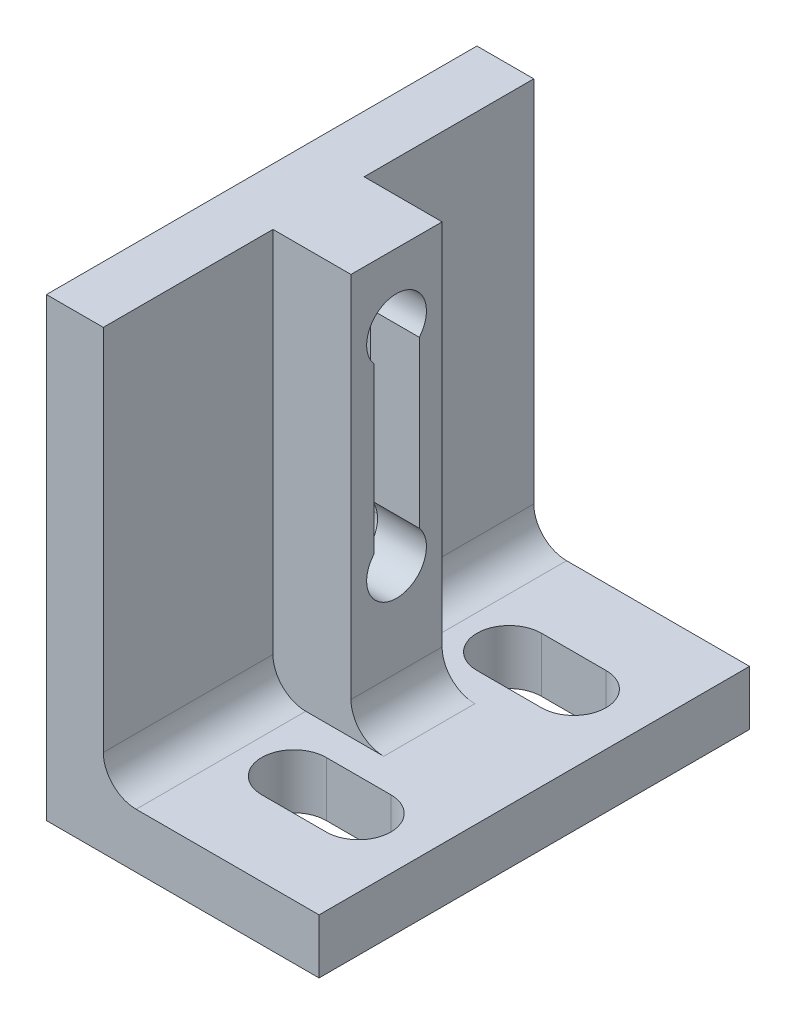
ISO-10303-21;
HEADER;
FILE_DESCRIPTION(('STEP AP214'),'2;1');
FILE_NAME('part.step','',(''),(''),'','','');
FILE_SCHEMA(('AUTOMOTIVE_DESIGN { 1 0 10303 214 1 1 1 1 }'));
ENDSEC;
DATA;
#1=APPLICATION_CONTEXT('core data for automotive mechanical design processes');
#2=APPLICATION_PROTOCOL_DEFINITION('international standard','automotive_design',2000,#1);
#3=PRODUCT_CONTEXT('',#1,'mechanical');
#4=PRODUCT('Part','Part','',(#3));
#5=PRODUCT_RELATED_PRODUCT_CATEGORY('part','',(#4));
#6=PRODUCT_DEFINITION_FORMATION('','',#4);
#7=PRODUCT_DEFINITION_CONTEXT('part definition',#1,'design');
#8=PRODUCT_DEFINITION('design','',#6,#7);
#9=PRODUCT_DEFINITION_SHAPE('','',#8);
#10=(LENGTH_UNIT() NAMED_UNIT(*) SI_UNIT(.MILLI.,.METRE.));
#11=(NAMED_UNIT(*) PLANE_ANGLE_UNIT() SI_UNIT($,.RADIAN.));
#12=(NAMED_UNIT(*) SI_UNIT($,.STERADIAN.) SOLID_ANGLE_UNIT());
#13=UNCERTAINTY_MEASURE_WITH_UNIT(LENGTH_MEASURE(1.E-05),#10,'distance_accuracy_value','');
#14=(GEOMETRIC_REPRESENTATION_CONTEXT(3) GLOBAL_UNCERTAINTY_ASSIGNED_CONTEXT((#13)) GLOBAL_UNIT_ASSIGNED_CONTEXT((#10,
#11,#12)) REPRESENTATION_CONTEXT('',''));
#15=CARTESIAN_POINT('',(0.,0.,0.));
#16=DIRECTION('',(0.,0.,1.));
#17=DIRECTION('',(1.,0.,0.));
#18=AXIS2_PLACEMENT_3D('',#15,#16,#17);
#19=CARTESIAN_POINT('',(0.,0.,-30.));
#20=DIRECTION('',(1.,0.,0.));
#21=DIRECTION('',(0.,0.,-1.));
#22=AXIS2_PLACEMENT_3D('',#19,#20,#21);
#23=PLANE('',#22);
#24=DIRECTION('',(0.,1.,0.));
#25=VECTOR('',#24,1.);
#26=CARTESIAN_POINT('',(0.,0.,0.));
#27=LINE('',#26,#25);
#28=CARTESIAN_POINT('',(0.,0.,0.));
#29=VERTEX_POINT('',#28);
#30=CARTESIAN_POINT('',(0.,31.75,0.));
#31=VERTEX_POINT('',#30);
#32=EDGE_CURVE('E393',#29,#31,#27,.T.);
#33=ORIENTED_EDGE('',*,*,#32,.T.);
#34=DIRECTION('',(0.,0.,1.));
#35=VECTOR('',#34,1.);
#36=CARTESIAN_POINT('',(0.,31.75,-30.));
#37=LINE('',#36,#35);
#38=CARTESIAN_POINT('',(0.,31.75,-30.));
#39=VERTEX_POINT('',#38);
#40=EDGE_CURVE('E390',#39,#31,#37,.T.);
#41=ORIENTED_EDGE('',*,*,#40,.F.);
#42=DIRECTION('',(0.,1.,0.));
#43=VECTOR('',#42,1.);
#44=CARTESIAN_POINT('',(0.,0.,-30.));
#45=LINE('',#44,#43);
#46=CARTESIAN_POINT('',(0.,0.,-30.));
#47=VERTEX_POINT('',#46);
#48=EDGE_CURVE('E380',#47,#39,#45,.T.);
#49=ORIENTED_EDGE('',*,*,#48,.F.);
#50=DIRECTION('',(0.,0.,1.));
#51=VECTOR('',#50,1.);
#52=CARTESIAN_POINT('',(0.,0.,-30.));
#53=LINE('',#52,#51);
#54=EDGE_CURVE('E407',#47,#29,#53,.T.);
#55=ORIENTED_EDGE('',*,*,#54,.T.);
#56=EDGE_LOOP('',(#33,#41,#49,#55));
#57=FACE_BOUND('',#56,.T.);
#58=CARTESIAN_POINT('',(0.,12.7,-15.));
#59=DIRECTION('',(1.,0.,0.));
#60=DIRECTION('',(0.,0.,-1.));
#61=AXIS2_PLACEMENT_3D('',#58,#59,#60);
#62=CIRCLE('',#61,2.3749);
#63=CARTESIAN_POINT('',(0.,12.7,-12.6251));
#64=VERTEX_POINT('',#63);
#65=CARTESIAN_POINT('',(0.,12.7,-17.3749));
#66=VERTEX_POINT('',#65);
#67=EDGE_CURVE('E61',#64,#66,#62,.T.);
#68=ORIENTED_EDGE('',*,*,#67,.T.);
#69=DIRECTION('',(0.,1.,0.));
#70=VECTOR('',#69,1.);
#71=CARTESIAN_POINT('',(0.,12.7,-17.3749));
#72=LINE('',#71,#70);
#73=CARTESIAN_POINT('',(0.,26.924,-17.3749));
#74=VERTEX_POINT('',#73);
#75=EDGE_CURVE('E255',#66,#74,#72,.T.);
#76=ORIENTED_EDGE('',*,*,#75,.T.);
#77=CARTESIAN_POINT('',(0.,26.924,-15.));
#78=DIRECTION('',(1.,0.,0.));
#79=DIRECTION('',(0.,0.,-1.));
#80=AXIS2_PLACEMENT_3D('',#77,#78,#79);
#81=CIRCLE('',#80,2.3749);
#82=CARTESIAN_POINT('',(0.,26.924,-12.6251));
#83=VERTEX_POINT('',#82);
#84=EDGE_CURVE('E834',#74,#83,#81,.T.);
#85=ORIENTED_EDGE('',*,*,#84,.T.);
#86=DIRECTION('',(0.,-1.,0.));
#87=VECTOR('',#86,1.);
#88=CARTESIAN_POINT('',(0.,12.7,-12.6251));
#89=LINE('',#88,#87);
#90=EDGE_CURVE('E251',#83,#64,#89,.T.);
#91=ORIENTED_EDGE('',*,*,#90,.T.);
#92=EDGE_LOOP('',(#68,#76,#85,#91));
#93=FACE_BOUND('',#92,.T.);
#94=ADVANCED_FACE('F46',(#57,#93),#23,.F.);
#95=CARTESIAN_POINT('',(0.,3.81,-30.));
#96=DIRECTION('',(0.,1.,0.));
#97=DIRECTION('',(0.,0.,1.));
#98=AXIS2_PLACEMENT_3D('',#95,#96,#97);
#99=PLANE('',#98);
#100=DIRECTION('',(1.,0.,0.));
#101=VECTOR('',#100,1.);
#102=CARTESIAN_POINT('',(14.2502,3.81,-5.25));
#103=LINE('',#102,#101);
#104=CARTESIAN_POINT('',(9.7502,3.81,-5.25));
#105=VERTEX_POINT('',#104);
#106=CARTESIAN_POINT('',(14.2502,3.81,-5.25));
#107=VERTEX_POINT('',#106);
#108=EDGE_CURVE('E328',#105,#107,#103,.T.);
#109=ORIENTED_EDGE('',*,*,#108,.F.);
#110=CARTESIAN_POINT('',(9.7502,3.81,-7.5));
#111=DIRECTION('',(0.,1.,0.));
#112=DIRECTION('',(0.,0.,1.));
#113=AXIS2_PLACEMENT_3D('',#110,#111,#112);
#114=CIRCLE('',#113,2.25);
#115=CARTESIAN_POINT('',(9.7502,3.81,-9.75));
#116=VERTEX_POINT('',#115);
#117=EDGE_CURVE('E312',#116,#105,#114,.T.);
#118=ORIENTED_EDGE('',*,*,#117,.F.);
#119=DIRECTION('',(-1.,0.,0.));
#120=VECTOR('',#119,1.);
#121=CARTESIAN_POINT('',(9.7502,3.81,-9.75));
#122=LINE('',#121,#120);
#123=CARTESIAN_POINT('',(14.2502,3.81,-9.75));
#124=VERTEX_POINT('',#123);
#125=EDGE_CURVE('E317',#124,#116,#122,.T.);
#126=ORIENTED_EDGE('',*,*,#125,.F.);
#127=CARTESIAN_POINT('',(14.2502,3.81,-7.5));
#128=DIRECTION('',(0.,1.,0.));
#129=DIRECTION('',(0.,0.,1.));
#130=AXIS2_PLACEMENT_3D('',#127,#128,#129);
#131=CIRCLE('',#130,2.25);
#132=EDGE_CURVE('E331',#107,#124,#131,.T.);
#133=ORIENTED_EDGE('',*,*,#132,.F.);
#134=EDGE_LOOP('',(#109,#118,#126,#133));
#135=FACE_BOUND('',#134,.T.);
#136=DIRECTION('',(1.,0.,0.));
#137=VECTOR('',#136,1.);
#138=CARTESIAN_POINT('',(9.7502,3.81,-20.25));
#139=LINE('',#138,#137);
#140=CARTESIAN_POINT('',(9.7502,3.81,-20.25));
#141=VERTEX_POINT('',#140);
#142=CARTESIAN_POINT('',(14.2502,3.81,-20.25));
#143=VERTEX_POINT('',#142);
#144=EDGE_CURVE('E349',#141,#143,#139,.T.);
#145=ORIENTED_EDGE('',*,*,#144,.F.);
#146=CARTESIAN_POINT('',(9.7502,3.81,-22.5));
#147=DIRECTION('',(0.,1.,0.));
#148=DIRECTION('',(0.,0.,1.));
#149=AXIS2_PLACEMENT_3D('',#146,#147,#148);
#150=CIRCLE('',#149,2.25);
#151=CARTESIAN_POINT('',(9.7502,3.81,-24.75));
#152=VERTEX_POINT('',#151);
#153=EDGE_CURVE('E363',#152,#141,#150,.T.);
#154=ORIENTED_EDGE('',*,*,#153,.F.);
#155=DIRECTION('',(-1.,0.,0.));
#156=VECTOR('',#155,1.);
#157=CARTESIAN_POINT('',(14.2502,3.81,-24.75));
#158=LINE('',#157,#156);
#159=CARTESIAN_POINT('',(14.2502,3.81,-24.75));
#160=VERTEX_POINT('',#159);
#161=EDGE_CURVE('E360',#160,#152,#158,.T.);
#162=ORIENTED_EDGE('',*,*,#161,.F.);
#163=CARTESIAN_POINT('',(14.2502,3.81,-22.5));
#164=DIRECTION('',(0.,1.,0.));
#165=DIRECTION('',(0.,0.,1.));
#166=AXIS2_PLACEMENT_3D('',#163,#164,#165);
#167=CIRCLE('',#166,2.25);
#168=EDGE_CURVE('E338',#143,#160,#167,.T.);
#169=ORIENTED_EDGE('',*,*,#168,.F.);
#170=EDGE_LOOP('',(#145,#154,#162,#169));
#171=FACE_BOUND('',#170,.T.);
#172=DIRECTION('',(1.,0.,0.));
#173=VECTOR('',#172,1.);
#174=CARTESIAN_POINT('',(9.39799999999985,3.81,-11.825));
#175=LINE('',#174,#173);
#176=CARTESIAN_POINT('',(6.24840000000002,3.81,-11.825));
#177=VERTEX_POINT('',#176);
#178=CARTESIAN_POINT('',(11.684,3.81,-11.825));
#179=VERTEX_POINT('',#178);
#180=EDGE_CURVE('E278',#177,#179,#175,.T.);
#181=ORIENTED_EDGE('',*,*,#180,.F.);
#182=DIRECTION('',(0.,0.,-1.));
#183=VECTOR('',#182,1.);
#184=CARTESIAN_POINT('',(6.24840000000002,3.81,-30.));
#185=LINE('',#184,#183);
#186=CARTESIAN_POINT('',(6.24840000000002,3.81,0.));
#187=VERTEX_POINT('',#186);
#188=EDGE_CURVE('E438',#177,#187,#185,.F.);
#189=ORIENTED_EDGE('',*,*,#188,.T.);
#190=DIRECTION('',(1.,0.,0.));
#191=VECTOR('',#190,1.);
#192=CARTESIAN_POINT('',(0.,3.81,0.));
#193=LINE('',#192,#191);
#194=CARTESIAN_POINT('',(19.,3.81,0.));
#195=VERTEX_POINT('',#194);
#196=EDGE_CURVE('E381',#195,#187,#193,.F.);
#197=ORIENTED_EDGE('',*,*,#196,.F.);
#198=DIRECTION('',(0.,0.,1.));
#199=VECTOR('',#198,1.);
#200=CARTESIAN_POINT('',(19.,3.81,-30.));
#201=LINE('',#200,#199);
#202=CARTESIAN_POINT('',(19.,3.81,-30.));
#203=VERTEX_POINT('',#202);
#204=EDGE_CURVE('E401',#203,#195,#201,.T.);
#205=ORIENTED_EDGE('',*,*,#204,.F.);
#206=DIRECTION('',(1.,0.,0.));
#207=VECTOR('',#206,1.);
#208=CARTESIAN_POINT('',(0.,3.81,-30.));
#209=LINE('',#208,#207);
#210=CARTESIAN_POINT('',(6.24840000000002,3.81,-30.));
#211=VERTEX_POINT('',#210);
#212=EDGE_CURVE('E387',#203,#211,#209,.F.);
#213=ORIENTED_EDGE('',*,*,#212,.T.);
#214=DIRECTION('',(0.,0.,-1.));
#215=VECTOR('',#214,1.);
#216=CARTESIAN_POINT('',(6.24840000000002,3.81,-30.));
#217=LINE('',#216,#215);
#218=CARTESIAN_POINT('',(6.24840000000002,3.81,-18.175));
#219=VERTEX_POINT('',#218);
#220=EDGE_CURVE('E436',#211,#219,#217,.F.);
#221=ORIENTED_EDGE('',*,*,#220,.T.);
#222=DIRECTION('',(-1.,0.,0.));
#223=VECTOR('',#222,1.);
#224=CARTESIAN_POINT('',(9.39799999999985,3.81,-18.175));
#225=LINE('',#224,#223);
#226=CARTESIAN_POINT('',(11.684,3.81,-18.175));
#227=VERTEX_POINT('',#226);
#228=EDGE_CURVE('E284',#227,#219,#225,.T.);
#229=ORIENTED_EDGE('',*,*,#228,.F.);
#230=DIRECTION('',(0.,0.,1.));
#231=VECTOR('',#230,1.);
#232=CARTESIAN_POINT('',(11.684,3.81,-11.825));
#233=LINE('',#232,#231);
#234=EDGE_CURVE('E421',#227,#179,#233,.T.);
#235=ORIENTED_EDGE('',*,*,#234,.T.);
#236=EDGE_LOOP('',(#181,#189,#197,#205,#213,#221,#229,#235));
#237=FACE_BOUND('',#236,.T.);
#238=ADVANCED_FACE('F455',(#135,#171,#237),#99,.T.);
#239=CARTESIAN_POINT('',(19.,3.81,-30.));
#240=DIRECTION('',(-1.,0.,0.));
#241=DIRECTION('',(0.,-1.,0.));
#242=AXIS2_PLACEMENT_3D('',#239,#240,#241);
#243=PLANE('',#242);
#244=DIRECTION('',(0.,-1.,0.));
#245=VECTOR('',#244,1.);
#246=CARTESIAN_POINT('',(19.,3.81,0.));
#247=LINE('',#246,#245);
#248=CARTESIAN_POINT('',(19.,0.,0.));
#249=VERTEX_POINT('',#248);
#250=EDGE_CURVE('E397',#195,#249,#247,.T.);
#251=ORIENTED_EDGE('',*,*,#250,.T.);
#252=DIRECTION('',(0.,0.,1.));
#253=VECTOR('',#252,1.);
#254=CARTESIAN_POINT('',(19.,0.,-30.));
#255=LINE('',#254,#253);
#256=CARTESIAN_POINT('',(19.,0.,-30.));
#257=VERTEX_POINT('',#256);
#258=EDGE_CURVE('E404',#257,#249,#255,.T.);
#259=ORIENTED_EDGE('',*,*,#258,.F.);
#260=DIRECTION('',(0.,-1.,0.));
#261=VECTOR('',#260,1.);
#262=CARTESIAN_POINT('',(19.,3.81,-30.));
#263=LINE('',#262,#261);
#264=EDGE_CURVE('E385',#203,#257,#263,.T.);
#265=ORIENTED_EDGE('',*,*,#264,.F.);
#266=ORIENTED_EDGE('',*,*,#204,.T.);
#267=EDGE_LOOP('',(#251,#259,#265,#266));
#268=FACE_BOUND('',#267,.T.);
#269=ADVANCED_FACE('F506',(#268),#243,.F.);
#270=CARTESIAN_POINT('',(0.,0.,-30.));
#271=DIRECTION('',(0.,1.,0.));
#272=DIRECTION('',(0.,0.,1.));
#273=AXIS2_PLACEMENT_3D('',#270,#271,#272);
#274=PLANE('',#273);
#275=DIRECTION('',(-1.,0.,0.));
#276=VECTOR('',#275,1.);
#277=CARTESIAN_POINT('',(9.7502,0.,-9.75));
#278=LINE('',#277,#276);
#279=CARTESIAN_POINT('',(14.2502,0.,-9.75));
#280=VERTEX_POINT('',#279);
#281=CARTESIAN_POINT('',(9.7502,0.,-9.75));
#282=VERTEX_POINT('',#281);
#283=EDGE_CURVE('E323',#280,#282,#278,.T.);
#284=ORIENTED_EDGE('',*,*,#283,.T.);
#285=CARTESIAN_POINT('',(9.7502,0.,-7.5));
#286=DIRECTION('',(0.,1.,0.));
#287=DIRECTION('',(0.,0.,1.));
#288=AXIS2_PLACEMENT_3D('',#285,#286,#287);
#289=CIRCLE('',#288,2.25);
#290=CARTESIAN_POINT('',(9.7502,0.,-5.25));
#291=VERTEX_POINT('',#290);
#292=EDGE_CURVE('E313',#282,#291,#289,.T.);
#293=ORIENTED_EDGE('',*,*,#292,.T.);
#294=DIRECTION('',(1.,0.,0.));
#295=VECTOR('',#294,1.);
#296=CARTESIAN_POINT('',(14.2502,0.,-5.25));
#297=LINE('',#296,#295);
#298=CARTESIAN_POINT('',(14.2502,0.,-5.25));
#299=VERTEX_POINT('',#298);
#300=EDGE_CURVE('E316',#291,#299,#297,.T.);
#301=ORIENTED_EDGE('',*,*,#300,.T.);
#302=CARTESIAN_POINT('',(14.2502,0.,-7.5));
#303=DIRECTION('',(0.,1.,0.));
#304=DIRECTION('',(0.,0.,1.));
#305=AXIS2_PLACEMENT_3D('',#302,#303,#304);
#306=CIRCLE('',#305,2.25);
#307=EDGE_CURVE('E320',#299,#280,#306,.T.);
#308=ORIENTED_EDGE('',*,*,#307,.T.);
#309=EDGE_LOOP('',(#284,#293,#301,#308));
#310=FACE_BOUND('',#309,.T.);
#311=DIRECTION('',(1.,0.,0.));
#312=VECTOR('',#311,1.);
#313=CARTESIAN_POINT('',(9.7502,0.,-20.25));
#314=LINE('',#313,#312);
#315=CARTESIAN_POINT('',(9.7502,0.,-20.25));
#316=VERTEX_POINT('',#315);
#317=CARTESIAN_POINT('',(14.2502,0.,-20.25));
#318=VERTEX_POINT('',#317);
#319=EDGE_CURVE('E355',#316,#318,#314,.T.);
#320=ORIENTED_EDGE('',*,*,#319,.T.);
#321=CARTESIAN_POINT('',(14.2502,0.,-22.5));
#322=DIRECTION('',(0.,1.,0.));
#323=DIRECTION('',(0.,0.,1.));
#324=AXIS2_PLACEMENT_3D('',#321,#322,#323);
#325=CIRCLE('',#324,2.25);
#326=CARTESIAN_POINT('',(14.2502,0.,-24.75));
#327=VERTEX_POINT('',#326);
#328=EDGE_CURVE('E345',#318,#327,#325,.T.);
#329=ORIENTED_EDGE('',*,*,#328,.T.);
#330=DIRECTION('',(-1.,0.,0.));
#331=VECTOR('',#330,1.);
#332=CARTESIAN_POINT('',(14.2502,0.,-24.75));
#333=LINE('',#332,#331);
#334=CARTESIAN_POINT('',(9.7502,0.,-24.75));
#335=VERTEX_POINT('',#334);
#336=EDGE_CURVE('E348',#327,#335,#333,.T.);
#337=ORIENTED_EDGE('',*,*,#336,.T.);
#338=CARTESIAN_POINT('',(9.7502,0.,-22.5));
#339=DIRECTION('',(0.,1.,0.));
#340=DIRECTION('',(0.,0.,1.));
#341=AXIS2_PLACEMENT_3D('',#338,#339,#340);
#342=CIRCLE('',#341,2.25);
#343=EDGE_CURVE('E352',#335,#316,#342,.T.);
#344=ORIENTED_EDGE('',*,*,#343,.T.);
#345=EDGE_LOOP('',(#320,#329,#337,#344));
#346=FACE_BOUND('',#345,.T.);
#347=DIRECTION('',(-1.,0.,0.));
#348=VECTOR('',#347,1.);
#349=CARTESIAN_POINT('',(0.,0.,0.));
#350=LINE('',#349,#348);
#351=EDGE_CURVE('E395',#249,#29,#350,.T.);
#352=ORIENTED_EDGE('',*,*,#351,.T.);
#353=ORIENTED_EDGE('',*,*,#54,.F.);
#354=DIRECTION('',(-1.,0.,0.));
#355=VECTOR('',#354,1.);
#356=CARTESIAN_POINT('',(0.,0.,-30.));
#357=LINE('',#356,#355);
#358=EDGE_CURVE('E383',#257,#47,#357,.T.);
#359=ORIENTED_EDGE('',*,*,#358,.F.);
#360=ORIENTED_EDGE('',*,*,#258,.T.);
#361=EDGE_LOOP('',(#352,#353,#359,#360));
#362=FACE_BOUND('',#361,.T.);
#363=ADVANCED_FACE('F503',(#310,#346,#362),#274,.F.);
#364=CARTESIAN_POINT('',(0.,31.75,-30.));
#365=DIRECTION('',(0.,-1.,0.));
#366=DIRECTION('',(1.,0.,0.));
#367=AXIS2_PLACEMENT_3D('',#364,#365,#366);
#368=PLANE('',#367);
#369=DIRECTION('',(1.,0.,0.));
#370=VECTOR('',#369,1.);
#371=CARTESIAN_POINT('',(0.,31.75,0.));
#372=LINE('',#371,#370);
#373=CARTESIAN_POINT('',(3.96240000000012,31.75,0.));
#374=VERTEX_POINT('',#373);
#375=EDGE_CURVE('E369',#31,#374,#372,.T.);
#376=ORIENTED_EDGE('',*,*,#375,.T.);
#377=DIRECTION('',(0.,0.,1.));
#378=VECTOR('',#377,1.);
#379=CARTESIAN_POINT('',(3.96240000000012,31.75,0.));
#380=LINE('',#379,#378);
#381=CARTESIAN_POINT('',(3.96240000000012,31.75,-11.825));
#382=VERTEX_POINT('',#381);
#383=EDGE_CURVE('E272',#382,#374,#380,.T.);
#384=ORIENTED_EDGE('',*,*,#383,.F.);
#385=DIRECTION('',(-1.,0.,0.));
#386=VECTOR('',#385,1.);
#387=CARTESIAN_POINT('',(9.398,31.75,-11.825));
#388=LINE('',#387,#386);
#389=CARTESIAN_POINT('',(9.398,31.75,-11.825));
#390=VERTEX_POINT('',#389);
#391=EDGE_CURVE('E269',#390,#382,#388,.T.);
#392=ORIENTED_EDGE('',*,*,#391,.F.);
#393=DIRECTION('',(0.,0.,1.));
#394=VECTOR('',#393,1.);
#395=CARTESIAN_POINT('',(9.398,31.75,-58.4933210419565));
#396=LINE('',#395,#394);
#397=CARTESIAN_POINT('',(9.398,31.75,-18.175));
#398=VERTEX_POINT('',#397);
#399=EDGE_CURVE('E309',#398,#390,#396,.T.);
#400=ORIENTED_EDGE('',*,*,#399,.F.);
#401=DIRECTION('',(1.,0.,0.));
#402=VECTOR('',#401,1.);
#403=CARTESIAN_POINT('',(9.398,31.75,-18.175));
#404=LINE('',#403,#402);
#405=CARTESIAN_POINT('',(3.96240000000012,31.75,-18.175));
#406=VERTEX_POINT('',#405);
#407=EDGE_CURVE('E291',#406,#398,#404,.T.);
#408=ORIENTED_EDGE('',*,*,#407,.F.);
#409=DIRECTION('',(0.,0.,1.));
#410=VECTOR('',#409,1.);
#411=CARTESIAN_POINT('',(3.96240000000012,31.75,-30.));
#412=LINE('',#411,#410);
#413=CARTESIAN_POINT('',(3.96240000000012,31.75,-30.));
#414=VERTEX_POINT('',#413);
#415=EDGE_CURVE('E283',#414,#406,#412,.T.);
#416=ORIENTED_EDGE('',*,*,#415,.F.);
#417=DIRECTION('',(1.,0.,0.));
#418=VECTOR('',#417,1.);
#419=CARTESIAN_POINT('',(0.,31.75,-30.));
#420=LINE('',#419,#418);
#421=EDGE_CURVE('E377',#39,#414,#420,.T.);
#422=ORIENTED_EDGE('',*,*,#421,.F.);
#423=ORIENTED_EDGE('',*,*,#40,.T.);
#424=EDGE_LOOP('',(#376,#384,#392,#400,#408,#416,#422,#423));
#425=FACE_BOUND('',#424,.T.);
#426=ADVANCED_FACE('F469',(#425),#368,.F.);
#427=CARTESIAN_POINT('',(3.81,31.75,-30.));
#428=DIRECTION('',(0.,0.,-1.));
#429=DIRECTION('',(-1.,0.,0.));
#430=AXIS2_PLACEMENT_3D('',#427,#428,#429);
#431=PLANE('',#430);
#432=DIRECTION('',(0.,1.,0.));
#433=VECTOR('',#432,1.);
#434=CARTESIAN_POINT('',(3.96239999999997,-9.2044678093266,-30.));
#435=LINE('',#434,#433);
#436=CARTESIAN_POINT('',(3.96240000000002,6.09600000000001,-30.));
#437=VERTEX_POINT('',#436);
#438=EDGE_CURVE('E294',#437,#414,#435,.T.);
#439=ORIENTED_EDGE('',*,*,#438,.F.);
#440=CARTESIAN_POINT('',(6.24840000000002,6.096,-30.));
#441=DIRECTION('',(0.,0.,-1.));
#442=DIRECTION('',(-1.,0.,0.));
#443=AXIS2_PLACEMENT_3D('',#440,#441,#442);
#444=CIRCLE('',#443,2.286);
#445=EDGE_CURVE('E54',#437,#211,#444,.F.);
#446=ORIENTED_EDGE('',*,*,#445,.T.);
#447=ORIENTED_EDGE('',*,*,#212,.F.);
#448=ORIENTED_EDGE('',*,*,#264,.T.);
#449=ORIENTED_EDGE('',*,*,#358,.T.);
#450=ORIENTED_EDGE('',*,*,#48,.T.);
#451=ORIENTED_EDGE('',*,*,#421,.T.);
#452=EDGE_LOOP('',(#439,#446,#447,#448,#449,#450,#451));
#453=FACE_BOUND('',#452,.T.);
#454=ADVANCED_FACE('F449',(#453),#431,.T.);
#455=CARTESIAN_POINT('',(3.81,31.75,0.));
#456=DIRECTION('',(0.,0.,-1.));
#457=DIRECTION('',(-1.,0.,0.));
#458=AXIS2_PLACEMENT_3D('',#455,#456,#457);
#459=PLANE('',#458);
#460=ORIENTED_EDGE('',*,*,#196,.T.);
#461=CARTESIAN_POINT('',(6.24840000000002,6.096,0.));
#462=DIRECTION('',(0.,0.,-1.));
#463=DIRECTION('',(-1.,0.,0.));
#464=AXIS2_PLACEMENT_3D('',#461,#462,#463);
#465=CIRCLE('',#464,2.286);
#466=CARTESIAN_POINT('',(3.96240000000002,6.09600000000001,0.));
#467=VERTEX_POINT('',#466);
#468=EDGE_CURVE('E445',#187,#467,#465,.T.);
#469=ORIENTED_EDGE('',*,*,#468,.T.);
#470=DIRECTION('',(0.,1.,0.));
#471=VECTOR('',#470,1.);
#472=CARTESIAN_POINT('',(3.96239999999997,-9.2044678093266,0.));
#473=LINE('',#472,#471);
#474=EDGE_CURVE('E276',#467,#374,#473,.T.);
#475=ORIENTED_EDGE('',*,*,#474,.T.);
#476=ORIENTED_EDGE('',*,*,#375,.F.);
#477=ORIENTED_EDGE('',*,*,#32,.F.);
#478=ORIENTED_EDGE('',*,*,#351,.F.);
#479=ORIENTED_EDGE('',*,*,#250,.F.);
#480=EDGE_LOOP('',(#460,#469,#475,#476,#477,#478,#479));
#481=FACE_BOUND('',#480,.T.);
#482=ADVANCED_FACE('F487',(#481),#459,.F.);
#483=CARTESIAN_POINT('',(14.2502,0.,-22.5));
#484=DIRECTION('',(0.,1.,0.));
#485=DIRECTION('',(0.,0.,1.));
#486=AXIS2_PLACEMENT_3D('',#483,#484,#485);
#487=CYLINDRICAL_SURFACE('',#486,2.25);
#488=ORIENTED_EDGE('',*,*,#168,.T.);
#489=DIRECTION('',(0.,1.,0.));
#490=VECTOR('',#489,1.);
#491=CARTESIAN_POINT('',(14.2502,0.,-24.75));
#492=LINE('',#491,#490);
#493=EDGE_CURVE('E358',#327,#160,#492,.T.);
#494=ORIENTED_EDGE('',*,*,#493,.F.);
#495=ORIENTED_EDGE('',*,*,#328,.F.);
#496=DIRECTION('',(0.,1.,0.));
#497=VECTOR('',#496,1.);
#498=CARTESIAN_POINT('',(14.2502,0.,-20.25));
#499=LINE('',#498,#497);
#500=EDGE_CURVE('E367',#318,#143,#499,.T.);
#501=ORIENTED_EDGE('',*,*,#500,.T.);
#502=EDGE_LOOP('',(#488,#494,#495,#501));
#503=FACE_BOUND('',#502,.T.);
#504=ADVANCED_FACE('F597',(#503),#487,.F.);
#505=CARTESIAN_POINT('',(9.7502,0.,-20.25));
#506=DIRECTION('',(0.,0.,1.));
#507=DIRECTION('',(1.,0.,0.));
#508=AXIS2_PLACEMENT_3D('',#505,#506,#507);
#509=PLANE('',#508);
#510=ORIENTED_EDGE('',*,*,#144,.T.);
#511=ORIENTED_EDGE('',*,*,#500,.F.);
#512=ORIENTED_EDGE('',*,*,#319,.F.);
#513=DIRECTION('',(0.,1.,0.));
#514=VECTOR('',#513,1.);
#515=CARTESIAN_POINT('',(9.7502,0.,-20.25));
#516=LINE('',#515,#514);
#517=EDGE_CURVE('E370',#316,#141,#516,.T.);
#518=ORIENTED_EDGE('',*,*,#517,.T.);
#519=EDGE_LOOP('',(#510,#511,#512,#518));
#520=FACE_BOUND('',#519,.T.);
#521=ADVANCED_FACE('F593',(#520),#509,.F.);
#522=CARTESIAN_POINT('',(9.7502,0.,-22.5));
#523=DIRECTION('',(0.,1.,0.));
#524=DIRECTION('',(0.,0.,1.));
#525=AXIS2_PLACEMENT_3D('',#522,#523,#524);
#526=CYLINDRICAL_SURFACE('',#525,2.25);
#527=ORIENTED_EDGE('',*,*,#153,.T.);
#528=ORIENTED_EDGE('',*,*,#517,.F.);
#529=ORIENTED_EDGE('',*,*,#343,.F.);
#530=DIRECTION('',(0.,1.,0.));
#531=VECTOR('',#530,1.);
#532=CARTESIAN_POINT('',(9.7502,0.,-24.75));
#533=LINE('',#532,#531);
#534=EDGE_CURVE('E373',#335,#152,#533,.T.);
#535=ORIENTED_EDGE('',*,*,#534,.T.);
#536=EDGE_LOOP('',(#527,#528,#529,#535));
#537=FACE_BOUND('',#536,.T.);
#538=ADVANCED_FACE('F596',(#537),#526,.F.);
#539=CARTESIAN_POINT('',(14.2502,0.,-24.75));
#540=DIRECTION('',(0.,0.,-1.));
#541=DIRECTION('',(-1.,0.,0.));
#542=AXIS2_PLACEMENT_3D('',#539,#540,#541);
#543=PLANE('',#542);
#544=ORIENTED_EDGE('',*,*,#161,.T.);
#545=ORIENTED_EDGE('',*,*,#534,.F.);
#546=ORIENTED_EDGE('',*,*,#336,.F.);
#547=ORIENTED_EDGE('',*,*,#493,.T.);
#548=EDGE_LOOP('',(#544,#545,#546,#547));
#549=FACE_BOUND('',#548,.T.);
#550=ADVANCED_FACE('F591',(#549),#543,.F.);
#551=CARTESIAN_POINT('',(9.7502,0.,-7.5));
#552=DIRECTION('',(0.,1.,0.));
#553=DIRECTION('',(0.,0.,1.));
#554=AXIS2_PLACEMENT_3D('',#551,#552,#553);
#555=CYLINDRICAL_SURFACE('',#554,2.25);
#556=ORIENTED_EDGE('',*,*,#117,.T.);
#557=DIRECTION('',(0.,1.,0.));
#558=VECTOR('',#557,1.);
#559=CARTESIAN_POINT('',(9.7502,0.,-5.25));
#560=LINE('',#559,#558);
#561=EDGE_CURVE('E326',#291,#105,#560,.T.);
#562=ORIENTED_EDGE('',*,*,#561,.F.);
#563=ORIENTED_EDGE('',*,*,#292,.F.);
#564=DIRECTION('',(0.,1.,0.));
#565=VECTOR('',#564,1.);
#566=CARTESIAN_POINT('',(9.7502,0.,-9.75));
#567=LINE('',#566,#565);
#568=EDGE_CURVE('E336',#282,#116,#567,.T.);
#569=ORIENTED_EDGE('',*,*,#568,.T.);
#570=EDGE_LOOP('',(#556,#562,#563,#569));
#571=FACE_BOUND('',#570,.T.);
#572=ADVANCED_FACE('F581',(#571),#555,.F.);
#573=CARTESIAN_POINT('',(9.7502,0.,-9.75));
#574=DIRECTION('',(0.,0.,-1.));
#575=DIRECTION('',(-1.,0.,0.));
#576=AXIS2_PLACEMENT_3D('',#573,#574,#575);
#577=PLANE('',#576);
#578=ORIENTED_EDGE('',*,*,#125,.T.);
#579=ORIENTED_EDGE('',*,*,#568,.F.);
#580=ORIENTED_EDGE('',*,*,#283,.F.);
#581=DIRECTION('',(0.,1.,0.));
#582=VECTOR('',#581,1.);
#583=CARTESIAN_POINT('',(14.2502,0.,-9.75));
#584=LINE('',#583,#582);
#585=EDGE_CURVE('E339',#280,#124,#584,.T.);
#586=ORIENTED_EDGE('',*,*,#585,.T.);
#587=EDGE_LOOP('',(#578,#579,#580,#586));
#588=FACE_BOUND('',#587,.T.);
#589=ADVANCED_FACE('F577',(#588),#577,.F.);
#590=CARTESIAN_POINT('',(14.2502,0.,-7.5));
#591=DIRECTION('',(0.,1.,0.));
#592=DIRECTION('',(0.,0.,1.));
#593=AXIS2_PLACEMENT_3D('',#590,#591,#592);
#594=CYLINDRICAL_SURFACE('',#593,2.25);
#595=ORIENTED_EDGE('',*,*,#132,.T.);
#596=ORIENTED_EDGE('',*,*,#585,.F.);
#597=ORIENTED_EDGE('',*,*,#307,.F.);
#598=DIRECTION('',(0.,1.,0.));
#599=VECTOR('',#598,1.);
#600=CARTESIAN_POINT('',(14.2502,0.,-5.25));
#601=LINE('',#600,#599);
#602=EDGE_CURVE('E341',#299,#107,#601,.T.);
#603=ORIENTED_EDGE('',*,*,#602,.T.);
#604=EDGE_LOOP('',(#595,#596,#597,#603));
#605=FACE_BOUND('',#604,.T.);
#606=ADVANCED_FACE('F580',(#605),#594,.F.);
#607=CARTESIAN_POINT('',(14.2502,0.,-5.25));
#608=DIRECTION('',(0.,0.,1.));
#609=DIRECTION('',(1.,0.,0.));
#610=AXIS2_PLACEMENT_3D('',#607,#608,#609);
#611=PLANE('',#610);
#612=ORIENTED_EDGE('',*,*,#108,.T.);
#613=ORIENTED_EDGE('',*,*,#602,.F.);
#614=ORIENTED_EDGE('',*,*,#300,.F.);
#615=ORIENTED_EDGE('',*,*,#561,.T.);
#616=EDGE_LOOP('',(#612,#613,#614,#615));
#617=FACE_BOUND('',#616,.T.);
#618=ADVANCED_FACE('F576',(#617),#611,.F.);
#619=CARTESIAN_POINT('',(9.398,31.75,-58.4933210419565));
#620=DIRECTION('',(1.,0.,0.));
#621=DIRECTION('',(0.,1.,0.));
#622=AXIS2_PLACEMENT_3D('',#619,#620,#621);
#623=PLANE('',#622);
#624=DIRECTION('',(0.,1.,0.));
#625=VECTOR('',#624,1.);
#626=CARTESIAN_POINT('',(9.39799999999985,-9.20446780932662,-11.825));
#627=LINE('',#626,#625);
#628=CARTESIAN_POINT('',(9.39799999999991,6.096,-11.825));
#629=VERTEX_POINT('',#628);
#630=EDGE_CURVE('E275',#629,#390,#627,.T.);
#631=ORIENTED_EDGE('',*,*,#630,.F.);
#632=DIRECTION('',(0.,0.,1.));
#633=VECTOR('',#632,1.);
#634=CARTESIAN_POINT('',(9.398,6.096,-18.175));
#635=LINE('',#634,#633);
#636=CARTESIAN_POINT('',(9.39799999999991,6.096,-18.175));
#637=VERTEX_POINT('',#636);
#638=EDGE_CURVE('E424',#629,#637,#635,.F.);
#639=ORIENTED_EDGE('',*,*,#638,.T.);
#640=DIRECTION('',(0.,1.,0.));
#641=VECTOR('',#640,1.);
#642=CARTESIAN_POINT('',(9.39799999999985,-9.20446780932662,-18.175));
#643=LINE('',#642,#641);
#644=EDGE_CURVE('E288',#637,#398,#643,.T.);
#645=ORIENTED_EDGE('',*,*,#644,.T.);
#646=ORIENTED_EDGE('',*,*,#399,.T.);
#647=EDGE_LOOP('',(#631,#639,#645,#646));
#648=FACE_BOUND('',#647,.T.);
#649=CARTESIAN_POINT('',(9.398,12.7,-15.));
#650=DIRECTION('',(1.,0.,0.));
#651=DIRECTION('',(0.,0.,-1.));
#652=AXIS2_PLACEMENT_3D('',#649,#650,#651);
#653=CIRCLE('',#652,2.08279999999999);
#654=CARTESIAN_POINT('',(9.398,14.0482950678542,-13.4125));
#655=VERTEX_POINT('',#654);
#656=CARTESIAN_POINT('',(9.398,14.0482950678542,-16.5875));
#657=VERTEX_POINT('',#656);
#658=EDGE_CURVE('E287',#655,#657,#653,.T.);
#659=ORIENTED_EDGE('',*,*,#658,.F.);
#660=DIRECTION('',(0.,-1.,0.));
#661=VECTOR('',#660,1.);
#662=CARTESIAN_POINT('',(9.398,31.75,-13.4125));
#663=LINE('',#662,#661);
#664=CARTESIAN_POINT('',(9.398,25.5757049321458,-13.4125));
#665=VERTEX_POINT('',#664);
#666=EDGE_CURVE('E413',#665,#655,#663,.T.);
#667=ORIENTED_EDGE('',*,*,#666,.F.);
#668=CARTESIAN_POINT('',(9.398,26.924,-15.));
#669=DIRECTION('',(1.,0.,0.));
#670=DIRECTION('',(0.,0.,-1.));
#671=AXIS2_PLACEMENT_3D('',#668,#669,#670);
#672=CIRCLE('',#671,2.08279999999999);
#673=CARTESIAN_POINT('',(9.398,25.5757049321458,-16.5875));
#674=VERTEX_POINT('',#673);
#675=EDGE_CURVE('E304',#674,#665,#672,.T.);
#676=ORIENTED_EDGE('',*,*,#675,.F.);
#677=DIRECTION('',(0.,1.,0.));
#678=VECTOR('',#677,1.);
#679=CARTESIAN_POINT('',(9.398,31.75,-16.5875));
#680=LINE('',#679,#678);
#681=EDGE_CURVE('E403',#657,#674,#680,.T.);
#682=ORIENTED_EDGE('',*,*,#681,.F.);
#683=EDGE_LOOP('',(#659,#667,#676,#682));
#684=FACE_BOUND('',#683,.T.);
#685=ADVANCED_FACE('F569',(#648,#684),#623,.T.);
#686=CARTESIAN_POINT('',(0.,12.7,-13.4125));
#687=DIRECTION('',(0.,0.,1.));
#688=DIRECTION('',(0.,-1.,0.));
#689=AXIS2_PLACEMENT_3D('',#686,#687,#688);
#690=PLANE('',#689);
#691=DIRECTION('',(1.,0.,0.));
#692=VECTOR('',#691,1.);
#693=CARTESIAN_POINT('',(9.398,14.0482950678542,-13.4125));
#694=LINE('',#693,#692);
#695=CARTESIAN_POINT('',(5.9944,14.0482950678542,-13.4125));
#696=VERTEX_POINT('',#695);
#697=EDGE_CURVE('E301',#655,#696,#694,.F.);
#698=ORIENTED_EDGE('',*,*,#697,.T.);
#699=DIRECTION('',(0.,1.,0.));
#700=VECTOR('',#699,1.);
#701=CARTESIAN_POINT('',(5.9944,12.7,-13.4125));
#702=LINE('',#701,#700);
#703=CARTESIAN_POINT('',(5.9944,25.5757049321458,-13.4125));
#704=VERTEX_POINT('',#703);
#705=EDGE_CURVE('E69',#696,#704,#702,.T.);
#706=ORIENTED_EDGE('',*,*,#705,.T.);
#707=DIRECTION('',(1.,0.,0.));
#708=VECTOR('',#707,1.);
#709=CARTESIAN_POINT('',(9.398,25.5757049321458,-13.4125));
#710=LINE('',#709,#708);
#711=EDGE_CURVE('E307',#704,#665,#710,.T.);
#712=ORIENTED_EDGE('',*,*,#711,.T.);
#713=ORIENTED_EDGE('',*,*,#666,.T.);
#714=EDGE_LOOP('',(#698,#706,#712,#713));
#715=FACE_BOUND('',#714,.T.);
#716=ADVANCED_FACE('F566',(#715),#690,.F.);
#717=CARTESIAN_POINT('',(0.,12.7,-16.5875));
#718=DIRECTION('',(0.,0.,-1.));
#719=DIRECTION('',(-1.,0.,0.));
#720=AXIS2_PLACEMENT_3D('',#717,#718,#719);
#721=PLANE('',#720);
#722=DIRECTION('',(1.,0.,0.));
#723=VECTOR('',#722,1.);
#724=CARTESIAN_POINT('',(9.398,25.5757049321458,-16.5875));
#725=LINE('',#724,#723);
#726=CARTESIAN_POINT('',(5.9944,25.5757049321458,-16.5875));
#727=VERTEX_POINT('',#726);
#728=EDGE_CURVE('E416',#674,#727,#725,.F.);
#729=ORIENTED_EDGE('',*,*,#728,.T.);
#730=DIRECTION('',(0.,-1.,0.));
#731=VECTOR('',#730,1.);
#732=CARTESIAN_POINT('',(5.9944,12.7,-16.5875));
#733=LINE('',#732,#731);
#734=CARTESIAN_POINT('',(5.9944,14.0482950678542,-16.5875));
#735=VERTEX_POINT('',#734);
#736=EDGE_CURVE('E256',#727,#735,#733,.T.);
#737=ORIENTED_EDGE('',*,*,#736,.T.);
#738=DIRECTION('',(1.,0.,0.));
#739=VECTOR('',#738,1.);
#740=CARTESIAN_POINT('',(9.398,14.0482950678542,-16.5875));
#741=LINE('',#740,#739);
#742=EDGE_CURVE('E419',#735,#657,#741,.T.);
#743=ORIENTED_EDGE('',*,*,#742,.T.);
#744=ORIENTED_EDGE('',*,*,#681,.T.);
#745=EDGE_LOOP('',(#729,#737,#743,#744));
#746=FACE_BOUND('',#745,.T.);
#747=ADVANCED_FACE('F564',(#746),#721,.F.);
#748=CARTESIAN_POINT('',(9.398,26.924,-15.));
#749=DIRECTION('',(1.,0.,0.));
#750=DIRECTION('',(0.,0.,-1.));
#751=AXIS2_PLACEMENT_3D('',#748,#749,#750);
#752=CYLINDRICAL_SURFACE('',#751,2.08279999999999);
#753=ORIENTED_EDGE('',*,*,#711,.F.);
#754=CARTESIAN_POINT('',(5.9944,26.924,-15.));
#755=DIRECTION('',(1.,0.,0.));
#756=DIRECTION('',(0.,0.,-1.));
#757=AXIS2_PLACEMENT_3D('',#754,#755,#756);
#758=CIRCLE('',#757,2.08279999999999);
#759=EDGE_CURVE('E266',#704,#727,#758,.F.);
#760=ORIENTED_EDGE('',*,*,#759,.T.);
#761=ORIENTED_EDGE('',*,*,#728,.F.);
#762=ORIENTED_EDGE('',*,*,#675,.T.);
#763=EDGE_LOOP('',(#753,#760,#761,#762));
#764=FACE_BOUND('',#763,.T.);
#765=ADVANCED_FACE('F560',(#764),#752,.F.);
#766=CARTESIAN_POINT('',(9.398,12.7,-15.));
#767=DIRECTION('',(1.,0.,0.));
#768=DIRECTION('',(0.,0.,-1.));
#769=AXIS2_PLACEMENT_3D('',#766,#767,#768);
#770=CYLINDRICAL_SURFACE('',#769,2.08279999999999);
#771=ORIENTED_EDGE('',*,*,#742,.F.);
#772=CARTESIAN_POINT('',(5.9944,12.7,-15.));
#773=DIRECTION('',(1.,0.,0.));
#774=DIRECTION('',(0.,0.,-1.));
#775=AXIS2_PLACEMENT_3D('',#772,#773,#774);
#776=CIRCLE('',#775,2.08279999999999);
#777=EDGE_CURVE('E13',#735,#696,#776,.F.);
#778=ORIENTED_EDGE('',*,*,#777,.T.);
#779=ORIENTED_EDGE('',*,*,#697,.F.);
#780=ORIENTED_EDGE('',*,*,#658,.T.);
#781=EDGE_LOOP('',(#771,#778,#779,#780));
#782=FACE_BOUND('',#781,.T.);
#783=ADVANCED_FACE('F555',(#782),#770,.F.);
#784=CARTESIAN_POINT('',(9.39799999999985,-9.20446780932662,-18.175));
#785=DIRECTION('',(0.,0.,1.));
#786=DIRECTION('',(1.,0.,0.));
#787=AXIS2_PLACEMENT_3D('',#784,#785,#786);
#788=PLANE('',#787);
#789=ORIENTED_EDGE('',*,*,#228,.T.);
#790=CARTESIAN_POINT('',(6.24840000000002,6.096,-18.175));
#791=DIRECTION('',(0.,0.,1.));
#792=DIRECTION('',(1.,0.,0.));
#793=AXIS2_PLACEMENT_3D('',#790,#791,#792);
#794=CIRCLE('',#793,2.286);
#795=CARTESIAN_POINT('',(3.96240000000002,6.09600000000001,-18.175));
#796=VERTEX_POINT('',#795);
#797=EDGE_CURVE('E443',#219,#796,#794,.F.);
#798=ORIENTED_EDGE('',*,*,#797,.T.);
#799=DIRECTION('',(0.,1.,0.));
#800=VECTOR('',#799,1.);
#801=CARTESIAN_POINT('',(3.96239999999997,-9.2044678093266,-18.175));
#802=LINE('',#801,#800);
#803=EDGE_CURVE('E296',#796,#406,#802,.T.);
#804=ORIENTED_EDGE('',*,*,#803,.T.);
#805=ORIENTED_EDGE('',*,*,#407,.T.);
#806=ORIENTED_EDGE('',*,*,#644,.F.);
#807=CARTESIAN_POINT('',(11.684,6.096,-18.175));
#808=DIRECTION('',(0.,0.,1.));
#809=DIRECTION('',(1.,0.,0.));
#810=AXIS2_PLACEMENT_3D('',#807,#808,#809);
#811=CIRCLE('',#810,2.286);
#812=EDGE_CURVE('E428',#637,#227,#811,.T.);
#813=ORIENTED_EDGE('',*,*,#812,.T.);
#814=EDGE_LOOP('',(#789,#798,#804,#805,#806,#813));
#815=FACE_BOUND('',#814,.T.);
#816=ADVANCED_FACE('F461',(#815),#788,.F.);
#817=CARTESIAN_POINT('',(3.96239999999997,-9.2044678093266,-30.));
#818=DIRECTION('',(-1.,0.,0.));
#819=DIRECTION('',(0.,-1.,0.));
#820=AXIS2_PLACEMENT_3D('',#817,#818,#819);
#821=PLANE('',#820);
#822=ORIENTED_EDGE('',*,*,#803,.F.);
#823=DIRECTION('',(0.,0.,-1.));
#824=VECTOR('',#823,1.);
#825=CARTESIAN_POINT('',(3.96240000000002,6.09600000000001,-30.));
#826=LINE('',#825,#824);
#827=EDGE_CURVE('E440',#796,#437,#826,.T.);
#828=ORIENTED_EDGE('',*,*,#827,.T.);
#829=ORIENTED_EDGE('',*,*,#438,.T.);
#830=ORIENTED_EDGE('',*,*,#415,.T.);
#831=EDGE_LOOP('',(#822,#828,#829,#830));
#832=FACE_BOUND('',#831,.T.);
#833=ADVANCED_FACE('F463',(#832),#821,.F.);
#834=CARTESIAN_POINT('',(3.96239999999997,-9.2044678093266,0.));
#835=DIRECTION('',(-1.,0.,0.));
#836=DIRECTION('',(0.,-1.,0.));
#837=AXIS2_PLACEMENT_3D('',#834,#835,#836);
#838=PLANE('',#837);
#839=ORIENTED_EDGE('',*,*,#474,.F.);
#840=DIRECTION('',(0.,0.,-1.));
#841=VECTOR('',#840,1.);
#842=CARTESIAN_POINT('',(3.96240000000002,6.09600000000001,0.));
#843=LINE('',#842,#841);
#844=CARTESIAN_POINT('',(3.96240000000002,6.09600000000001,-11.825));
#845=VERTEX_POINT('',#844);
#846=EDGE_CURVE('E431',#467,#845,#843,.T.);
#847=ORIENTED_EDGE('',*,*,#846,.T.);
#848=DIRECTION('',(0.,1.,0.));
#849=VECTOR('',#848,1.);
#850=CARTESIAN_POINT('',(3.96239999999997,-9.2044678093266,-11.825));
#851=LINE('',#850,#849);
#852=EDGE_CURVE('E279',#845,#382,#851,.T.);
#853=ORIENTED_EDGE('',*,*,#852,.T.);
#854=ORIENTED_EDGE('',*,*,#383,.T.);
#855=EDGE_LOOP('',(#839,#847,#853,#854));
#856=FACE_BOUND('',#855,.T.);
#857=ADVANCED_FACE('F491',(#856),#838,.F.);
#858=CARTESIAN_POINT('',(9.39799999999985,-9.20446780932662,-11.825));
#859=DIRECTION('',(0.,0.,-1.));
#860=DIRECTION('',(-1.,0.,0.));
#861=AXIS2_PLACEMENT_3D('',#858,#859,#860);
#862=PLANE('',#861);
#863=ORIENTED_EDGE('',*,*,#852,.F.);
#864=CARTESIAN_POINT('',(6.24840000000002,6.096,-11.825));
#865=DIRECTION('',(0.,0.,-1.));
#866=DIRECTION('',(-1.,0.,0.));
#867=AXIS2_PLACEMENT_3D('',#864,#865,#866);
#868=CIRCLE('',#867,2.286);
#869=EDGE_CURVE('E434',#845,#177,#868,.F.);
#870=ORIENTED_EDGE('',*,*,#869,.T.);
#871=ORIENTED_EDGE('',*,*,#180,.T.);
#872=CARTESIAN_POINT('',(11.684,6.096,-11.825));
#873=DIRECTION('',(0.,0.,-1.));
#874=DIRECTION('',(-1.,0.,0.));
#875=AXIS2_PLACEMENT_3D('',#872,#873,#874);
#876=CIRCLE('',#875,2.286);
#877=EDGE_CURVE('E426',#179,#629,#876,.T.);
#878=ORIENTED_EDGE('',*,*,#877,.T.);
#879=ORIENTED_EDGE('',*,*,#630,.T.);
#880=ORIENTED_EDGE('',*,*,#391,.T.);
#881=EDGE_LOOP('',(#863,#870,#871,#878,#879,#880));
#882=FACE_BOUND('',#881,.T.);
#883=ADVANCED_FACE('F525',(#882),#862,.F.);
#884=CARTESIAN_POINT('',(11.684,6.096,-30.));
#885=DIRECTION('',(0.,0.,-1.));
#886=DIRECTION('',(-1.,0.,0.));
#887=AXIS2_PLACEMENT_3D('',#884,#885,#886);
#888=CYLINDRICAL_SURFACE('',#887,2.286);
#889=ORIENTED_EDGE('',*,*,#812,.F.);
#890=ORIENTED_EDGE('',*,*,#638,.F.);
#891=ORIENTED_EDGE('',*,*,#877,.F.);
#892=ORIENTED_EDGE('',*,*,#234,.F.);
#893=EDGE_LOOP('',(#889,#890,#891,#892));
#894=FACE_BOUND('',#893,.T.);
#895=ADVANCED_FACE('F477',(#894),#888,.F.);
#896=CARTESIAN_POINT('',(6.24840000000002,6.096,0.));
#897=DIRECTION('',(0.,0.,-1.));
#898=DIRECTION('',(-1.,0.,0.));
#899=AXIS2_PLACEMENT_3D('',#896,#897,#898);
#900=CYLINDRICAL_SURFACE('',#899,2.286);
#901=ORIENTED_EDGE('',*,*,#468,.F.);
#902=ORIENTED_EDGE('',*,*,#188,.F.);
#903=ORIENTED_EDGE('',*,*,#869,.F.);
#904=ORIENTED_EDGE('',*,*,#846,.F.);
#905=EDGE_LOOP('',(#901,#902,#903,#904));
#906=FACE_BOUND('',#905,.T.);
#907=ADVANCED_FACE('F483',(#906),#900,.F.);
#908=CARTESIAN_POINT('',(6.24840000000002,6.096,-30.));
#909=DIRECTION('',(0.,0.,-1.));
#910=DIRECTION('',(-1.,0.,0.));
#911=AXIS2_PLACEMENT_3D('',#908,#909,#910);
#912=CYLINDRICAL_SURFACE('',#911,2.286);
#913=ORIENTED_EDGE('',*,*,#797,.F.);
#914=ORIENTED_EDGE('',*,*,#220,.F.);
#915=ORIENTED_EDGE('',*,*,#445,.F.);
#916=ORIENTED_EDGE('',*,*,#827,.F.);
#917=EDGE_LOOP('',(#913,#914,#915,#916));
#918=FACE_BOUND('',#917,.T.);
#919=ADVANCED_FACE('F48',(#918),#912,.F.);
#920=CARTESIAN_POINT('',(5.9944,12.7,-15.));
#921=DIRECTION('',(1.,0.,0.));
#922=DIRECTION('',(0.,0.,-1.));
#923=AXIS2_PLACEMENT_3D('',#920,#921,#922);
#924=PLANE('',#923);
#925=CARTESIAN_POINT('',(5.9944,12.7,-15.));
#926=DIRECTION('',(1.,0.,0.));
#927=DIRECTION('',(0.,0.,-1.));
#928=AXIS2_PLACEMENT_3D('',#925,#926,#927);
#929=CIRCLE('',#928,2.3749);
#930=CARTESIAN_POINT('',(5.9944,12.7,-12.6251));
#931=VERTEX_POINT('',#930);
#932=CARTESIAN_POINT('',(5.9944,12.7,-17.3749));
#933=VERTEX_POINT('',#932);
#934=EDGE_CURVE('E242',#931,#933,#929,.T.);
#935=ORIENTED_EDGE('',*,*,#934,.F.);
#936=DIRECTION('',(0.,-1.,0.));
#937=VECTOR('',#936,1.);
#938=CARTESIAN_POINT('',(5.9944,12.7,-12.6251));
#939=LINE('',#938,#937);
#940=CARTESIAN_POINT('',(5.9944,26.924,-12.6251));
#941=VERTEX_POINT('',#940);
#942=EDGE_CURVE('E844',#941,#931,#939,.T.);
#943=ORIENTED_EDGE('',*,*,#942,.F.);
#944=CARTESIAN_POINT('',(5.9944,26.924,-15.));
#945=DIRECTION('',(1.,0.,0.));
#946=DIRECTION('',(0.,0.,-1.));
#947=AXIS2_PLACEMENT_3D('',#944,#945,#946);
#948=CIRCLE('',#947,2.3749);
#949=CARTESIAN_POINT('',(5.9944,26.924,-17.3749));
#950=VERTEX_POINT('',#949);
#951=EDGE_CURVE('E243',#950,#941,#948,.T.);
#952=ORIENTED_EDGE('',*,*,#951,.F.);
#953=DIRECTION('',(0.,1.,0.));
#954=VECTOR('',#953,1.);
#955=CARTESIAN_POINT('',(5.9944,12.7,-17.3749));
#956=LINE('',#955,#954);
#957=EDGE_CURVE('E238',#933,#950,#956,.T.);
#958=ORIENTED_EDGE('',*,*,#957,.F.);
#959=EDGE_LOOP('',(#935,#943,#952,#958));
#960=FACE_BOUND('',#959,.T.);
#961=ORIENTED_EDGE('',*,*,#705,.F.);
#962=ORIENTED_EDGE('',*,*,#777,.F.);
#963=ORIENTED_EDGE('',*,*,#736,.F.);
#964=ORIENTED_EDGE('',*,*,#759,.F.);
#965=EDGE_LOOP('',(#961,#962,#963,#964));
#966=FACE_BOUND('',#965,.T.);
#967=ADVANCED_FACE('F240',(#960,#966),#924,.F.);
#968=CARTESIAN_POINT('',(5.9944,12.7,-15.));
#969=DIRECTION('',(-1.,0.,0.));
#970=DIRECTION('',(0.,0.,1.));
#971=AXIS2_PLACEMENT_3D('',#968,#969,#970);
#972=CYLINDRICAL_SURFACE('',#971,2.3749);
#973=ORIENTED_EDGE('',*,*,#67,.F.);
#974=DIRECTION('',(-1.,0.,0.));
#975=VECTOR('',#974,1.);
#976=CARTESIAN_POINT('',(5.9944,12.7,-12.6251));
#977=LINE('',#976,#975);
#978=EDGE_CURVE('E250',#931,#64,#977,.T.);
#979=ORIENTED_EDGE('',*,*,#978,.F.);
#980=ORIENTED_EDGE('',*,*,#934,.T.);
#981=DIRECTION('',(-1.,0.,0.));
#982=VECTOR('',#981,1.);
#983=CARTESIAN_POINT('',(5.9944,12.7,-17.3749));
#984=LINE('',#983,#982);
#985=EDGE_CURVE('E249',#933,#66,#984,.T.);
#986=ORIENTED_EDGE('',*,*,#985,.T.);
#987=EDGE_LOOP('',(#973,#979,#980,#986));
#988=FACE_BOUND('',#987,.T.);
#989=ADVANCED_FACE('F248',(#988),#972,.F.);
#990=CARTESIAN_POINT('',(5.9944,12.7,-17.3749));
#991=DIRECTION('',(0.,0.,1.));
#992=DIRECTION('',(0.,-1.,0.));
#993=AXIS2_PLACEMENT_3D('',#990,#991,#992);
#994=PLANE('',#993);
#995=ORIENTED_EDGE('',*,*,#75,.F.);
#996=ORIENTED_EDGE('',*,*,#985,.F.);
#997=ORIENTED_EDGE('',*,*,#957,.T.);
#998=DIRECTION('',(-1.,0.,0.));
#999=VECTOR('',#998,1.);
#1000=CARTESIAN_POINT('',(5.9944,26.924,-17.3749));
#1001=LINE('',#1000,#999);
#1002=EDGE_CURVE('E257',#950,#74,#1001,.T.);
#1003=ORIENTED_EDGE('',*,*,#1002,.T.);
#1004=EDGE_LOOP('',(#995,#996,#997,#1003));
#1005=FACE_BOUND('',#1004,.T.);
#1006=ADVANCED_FACE('F253',(#1005),#994,.T.);
#1007=CARTESIAN_POINT('',(5.9944,26.924,-15.));
#1008=DIRECTION('',(-1.,0.,0.));
#1009=DIRECTION('',(0.,0.,1.));
#1010=AXIS2_PLACEMENT_3D('',#1007,#1008,#1009);
#1011=CYLINDRICAL_SURFACE('',#1010,2.3749);
#1012=ORIENTED_EDGE('',*,*,#84,.F.);
#1013=ORIENTED_EDGE('',*,*,#1002,.F.);
#1014=ORIENTED_EDGE('',*,*,#951,.T.);
#1015=DIRECTION('',(-1.,0.,0.));
#1016=VECTOR('',#1015,1.);
#1017=CARTESIAN_POINT('',(5.9944,26.924,-12.6251));
#1018=LINE('',#1017,#1016);
#1019=EDGE_CURVE('E261',#941,#83,#1018,.T.);
#1020=ORIENTED_EDGE('',*,*,#1019,.T.);
#1021=EDGE_LOOP('',(#1012,#1013,#1014,#1020));
#1022=FACE_BOUND('',#1021,.T.);
#1023=ADVANCED_FACE('F542',(#1022),#1011,.F.);
#1024=CARTESIAN_POINT('',(5.9944,12.7,-12.6251));
#1025=DIRECTION('',(0.,0.,-1.));
#1026=DIRECTION('',(-1.,0.,0.));
#1027=AXIS2_PLACEMENT_3D('',#1024,#1025,#1026);
#1028=PLANE('',#1027);
#1029=ORIENTED_EDGE('',*,*,#90,.F.);
#1030=ORIENTED_EDGE('',*,*,#1019,.F.);
#1031=ORIENTED_EDGE('',*,*,#942,.T.);
#1032=ORIENTED_EDGE('',*,*,#978,.T.);
#1033=EDGE_LOOP('',(#1029,#1030,#1031,#1032));
#1034=FACE_BOUND('',#1033,.T.);
#1035=ADVANCED_FACE('F539',(#1034),#1028,.T.);
#1036=CLOSED_SHELL('',(#94,#238,#269,#363,#426,#454,#482,#504,#521,#538,#550,#572,#589,#606,
#618,#685,#716,#747,#765,#783,#816,#833,#857,#883,#895,#907,#919,#967,#989,#1006,#1023,#1035));
#1037=MANIFOLD_SOLID_BREP('B2',#1036);
#1038=ADVANCED_BREP_SHAPE_REPRESENTATION('',(#18,#1037),#14);
#1039=SHAPE_DEFINITION_REPRESENTATION(#9,#1038);
ENDSEC;
END-ISO-10303-21;
